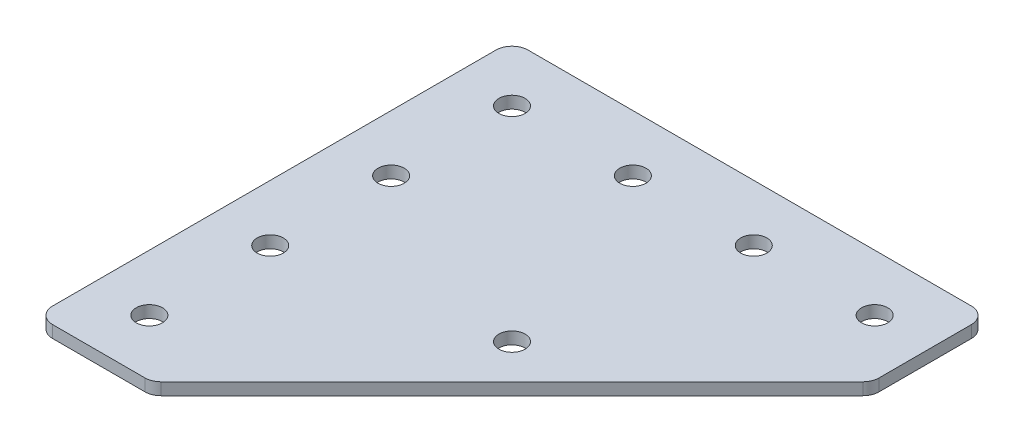
ISO-10303-21;
HEADER;
FILE_DESCRIPTION(('STEP AP214'),'2;1');
FILE_NAME('part.step','',(''),(''),'','','');
FILE_SCHEMA(('AUTOMOTIVE_DESIGN { 1 0 10303 214 1 1 1 1 }'));
ENDSEC;
DATA;
#1=APPLICATION_CONTEXT('core data for automotive mechanical design processes');
#2=APPLICATION_PROTOCOL_DEFINITION('international standard','automotive_design',2000,#1);
#3=PRODUCT_CONTEXT('',#1,'mechanical');
#4=PRODUCT('Part','Part','',(#3));
#5=PRODUCT_RELATED_PRODUCT_CATEGORY('part','',(#4));
#6=PRODUCT_DEFINITION_FORMATION('','',#4);
#7=PRODUCT_DEFINITION_CONTEXT('part definition',#1,'design');
#8=PRODUCT_DEFINITION('design','',#6,#7);
#9=PRODUCT_DEFINITION_SHAPE('','',#8);
#10=(LENGTH_UNIT() NAMED_UNIT(*) SI_UNIT(.MILLI.,.METRE.));
#11=(NAMED_UNIT(*) PLANE_ANGLE_UNIT() SI_UNIT($,.RADIAN.));
#12=(NAMED_UNIT(*) SI_UNIT($,.STERADIAN.) SOLID_ANGLE_UNIT());
#13=UNCERTAINTY_MEASURE_WITH_UNIT(LENGTH_MEASURE(1.E-05),#10,'distance_accuracy_value','');
#14=(GEOMETRIC_REPRESENTATION_CONTEXT(3) GLOBAL_UNCERTAINTY_ASSIGNED_CONTEXT((#13)) GLOBAL_UNIT_ASSIGNED_CONTEXT((#10,
#11,#12)) REPRESENTATION_CONTEXT('',''));
#15=CARTESIAN_POINT('',(0.,0.,0.));
#16=DIRECTION('',(0.,0.,1.));
#17=DIRECTION('',(1.,0.,0.));
#18=AXIS2_PLACEMENT_3D('',#15,#16,#17);
#19=CARTESIAN_POINT('',(-23.8452108311752,1.74134831028641,-23.6457325979904));
#20=DIRECTION('',(0.,-1.,0.));
#21=DIRECTION('',(0.,0.,-1.));
#22=AXIS2_PLACEMENT_3D('',#19,#20,#21);
#23=PLANE('',#22);
#24=CARTESIAN_POINT('',(1.48321629357095,1.74134831028641,1.68269452675578));
#25=DIRECTION('',(0.,1.,0.));
#26=DIRECTION('',(0.,0.,1.));
#27=AXIS2_PLACEMENT_3D('',#24,#25,#26);
#28=CIRCLE('',#27,1.625);
#29=CARTESIAN_POINT('',(1.48321629357095,1.74134831028641,3.30769452675578));
#30=VERTEX_POINT('',#29);
#31=EDGE_CURVE('E265',#30,#30,#28,.T.);
#32=ORIENTED_EDGE('',*,*,#31,.T.);
#33=EDGE_LOOP('',(#32));
#34=FACE_BOUND('',#33,.T.);
#35=CARTESIAN_POINT('',(-23.8452108311748,1.74134831028641,21.3542674020096));
#36=DIRECTION('',(0.,1.,0.));
#37=DIRECTION('',(0.,0.,1.));
#38=AXIS2_PLACEMENT_3D('',#35,#36,#37);
#39=CIRCLE('',#38,1.625);
#40=CARTESIAN_POINT('',(-23.8452108311748,1.74134831028641,22.9792674020096));
#41=VERTEX_POINT('',#40);
#42=EDGE_CURVE('E260',#41,#41,#39,.T.);
#43=ORIENTED_EDGE('',*,*,#42,.T.);
#44=EDGE_LOOP('',(#43));
#45=FACE_BOUND('',#44,.T.);
#46=CARTESIAN_POINT('',(-23.8452108311749,1.74134831028641,6.3542674020096));
#47=DIRECTION('',(0.,1.,0.));
#48=DIRECTION('',(0.,0.,1.));
#49=AXIS2_PLACEMENT_3D('',#46,#47,#48);
#50=CIRCLE('',#49,1.625);
#51=CARTESIAN_POINT('',(-23.8452108311749,1.74134831028641,7.9792674020096));
#52=VERTEX_POINT('',#51);
#53=EDGE_CURVE('E273',#52,#52,#50,.T.);
#54=ORIENTED_EDGE('',*,*,#53,.T.);
#55=EDGE_LOOP('',(#54));
#56=FACE_BOUND('',#55,.T.);
#57=CARTESIAN_POINT('',(-23.8452108311753,1.74134831028641,-8.6457325979904));
#58=DIRECTION('',(0.,1.,0.));
#59=DIRECTION('',(0.,0.,1.));
#60=AXIS2_PLACEMENT_3D('',#57,#58,#59);
#61=CIRCLE('',#60,1.62500000000016);
#62=CARTESIAN_POINT('',(-23.8452108311753,1.74134831028641,-7.02073259799024));
#63=VERTEX_POINT('',#62);
#64=EDGE_CURVE('E279',#63,#63,#61,.T.);
#65=ORIENTED_EDGE('',*,*,#64,.T.);
#66=EDGE_LOOP('',(#65));
#67=FACE_BOUND('',#66,.T.);
#68=CARTESIAN_POINT('',(21.1547891688248,1.74134831028641,-23.6457325979904));
#69=DIRECTION('',(0.,1.,0.));
#70=DIRECTION('',(0.,0.,1.));
#71=AXIS2_PLACEMENT_3D('',#68,#69,#70);
#72=CIRCLE('',#71,1.625);
#73=CARTESIAN_POINT('',(21.1547891688248,1.74134831028641,-22.0207325979904));
#74=VERTEX_POINT('',#73);
#75=EDGE_CURVE('E285',#74,#74,#72,.T.);
#76=ORIENTED_EDGE('',*,*,#75,.T.);
#77=EDGE_LOOP('',(#76));
#78=FACE_BOUND('',#77,.T.);
#79=CARTESIAN_POINT('',(6.15478916882476,1.74134831028641,-23.6457325979904));
#80=DIRECTION('',(0.,1.,0.));
#81=DIRECTION('',(0.,0.,1.));
#82=AXIS2_PLACEMENT_3D('',#79,#80,#81);
#83=CIRCLE('',#82,1.625);
#84=CARTESIAN_POINT('',(6.15478916882476,1.74134831028641,-22.0207325979904));
#85=VERTEX_POINT('',#84);
#86=EDGE_CURVE('E291',#85,#85,#83,.T.);
#87=ORIENTED_EDGE('',*,*,#86,.T.);
#88=EDGE_LOOP('',(#87));
#89=FACE_BOUND('',#88,.T.);
#90=CARTESIAN_POINT('',(-8.84521083117524,1.74134831028641,-23.6457325979904));
#91=DIRECTION('',(0.,1.,0.));
#92=DIRECTION('',(0.,0.,1.));
#93=AXIS2_PLACEMENT_3D('',#90,#91,#92);
#94=CIRCLE('',#93,1.625);
#95=CARTESIAN_POINT('',(-8.84521083117524,1.74134831028641,-22.0207325979904));
#96=VERTEX_POINT('',#95);
#97=EDGE_CURVE('E297',#96,#96,#94,.T.);
#98=ORIENTED_EDGE('',*,*,#97,.T.);
#99=EDGE_LOOP('',(#98));
#100=FACE_BOUND('',#99,.T.);
#101=CARTESIAN_POINT('',(-23.8452108311752,1.74134831028641,-23.6457325979904));
#102=DIRECTION('',(0.,1.,0.));
#103=DIRECTION('',(0.,0.,1.));
#104=AXIS2_PLACEMENT_3D('',#101,#102,#103);
#105=CIRCLE('',#104,1.625);
#106=CARTESIAN_POINT('',(-23.8452108311752,1.74134831028641,-22.0207325979904));
#107=VERTEX_POINT('',#106);
#108=EDGE_CURVE('E175',#107,#107,#105,.T.);
#109=ORIENTED_EDGE('',*,*,#108,.T.);
#110=EDGE_LOOP('',(#109));
#111=FACE_BOUND('',#110,.T.);
#112=DIRECTION('',(0.707106781186547,0.,-0.707106781186548));
#113=VECTOR('',#112,1.);
#114=CARTESIAN_POINT('',(-16.5523176123617,1.74134831028641,28.3542674020096));
#115=LINE('',#114,#113);
#116=CARTESIAN_POINT('',(-15.9665311747348,1.74134831028641,27.7684809643826));
#117=VERTEX_POINT('',#116);
#118=CARTESIAN_POINT('',(27.5690027311978,1.74134831028641,-15.76705294155));
#119=VERTEX_POINT('',#118);
#120=EDGE_CURVE('E121',#117,#119,#115,.T.);
#121=ORIENTED_EDGE('',*,*,#120,.F.);
#122=CARTESIAN_POINT('',(-17.3807447371079,1.74134831028641,26.3542674020096));
#123=DIRECTION('',(0.,-1.,0.));
#124=DIRECTION('',(0.,0.,-1.));
#125=AXIS2_PLACEMENT_3D('',#122,#123,#124);
#126=CIRCLE('',#125,2.);
#127=CARTESIAN_POINT('',(-17.3807447371079,1.74134831028641,28.3542674020096));
#128=VERTEX_POINT('',#127);
#129=EDGE_CURVE('E145',#117,#128,#126,.T.);
#130=ORIENTED_EDGE('',*,*,#129,.T.);
#131=DIRECTION('',(1.,0.,0.));
#132=VECTOR('',#131,1.);
#133=CARTESIAN_POINT('',(-30.8452108311753,1.74134831028641,28.3542674020096));
#134=LINE('',#133,#132);
#135=CARTESIAN_POINT('',(-28.8452108311753,1.74134831028641,28.3542674020096));
#136=VERTEX_POINT('',#135);
#137=EDGE_CURVE('E162',#136,#128,#134,.T.);
#138=ORIENTED_EDGE('',*,*,#137,.F.);
#139=CARTESIAN_POINT('',(-28.8452108311753,1.74134831028641,26.3542674020096));
#140=DIRECTION('',(0.,-1.,0.));
#141=DIRECTION('',(0.,0.,-1.));
#142=AXIS2_PLACEMENT_3D('',#139,#140,#141);
#143=CIRCLE('',#142,2.);
#144=CARTESIAN_POINT('',(-30.8452108311753,1.74134831028641,26.3542674020096));
#145=VERTEX_POINT('',#144);
#146=EDGE_CURVE('E117',#136,#145,#143,.T.);
#147=ORIENTED_EDGE('',*,*,#146,.T.);
#148=DIRECTION('',(0.,0.,1.));
#149=VECTOR('',#148,1.);
#150=CARTESIAN_POINT('',(-30.8452108311753,1.74134831028641,-30.6457325979904));
#151=LINE('',#150,#149);
#152=CARTESIAN_POINT('',(-30.8452108311753,1.74134831028641,-28.6457325979904));
#153=VERTEX_POINT('',#152);
#154=EDGE_CURVE('E160',#153,#145,#151,.T.);
#155=ORIENTED_EDGE('',*,*,#154,.F.);
#156=CARTESIAN_POINT('',(-28.8452108311753,1.74134831028641,-28.6457325979904));
#157=DIRECTION('',(0.,-1.,0.));
#158=DIRECTION('',(0.,0.,-1.));
#159=AXIS2_PLACEMENT_3D('',#156,#157,#158);
#160=CIRCLE('',#159,2.);
#161=CARTESIAN_POINT('',(-28.8452108311753,1.74134831028641,-30.6457325979904));
#162=VERTEX_POINT('',#161);
#163=EDGE_CURVE('E140',#153,#162,#160,.T.);
#164=ORIENTED_EDGE('',*,*,#163,.T.);
#165=DIRECTION('',(-1.,0.,0.));
#166=VECTOR('',#165,1.);
#167=CARTESIAN_POINT('',(28.1547891688247,1.74134831028641,-30.6457325979905));
#168=LINE('',#167,#166);
#169=CARTESIAN_POINT('',(26.1547891688247,1.74134831028641,-30.6457325979905));
#170=VERTEX_POINT('',#169);
#171=EDGE_CURVE('E163',#170,#162,#168,.T.);
#172=ORIENTED_EDGE('',*,*,#171,.F.);
#173=CARTESIAN_POINT('',(26.1547891688247,1.74134831028641,-28.6457325979904));
#174=DIRECTION('',(0.,-1.,0.));
#175=DIRECTION('',(0.,0.,-1.));
#176=AXIS2_PLACEMENT_3D('',#173,#174,#175);
#177=CIRCLE('',#176,2.);
#178=CARTESIAN_POINT('',(28.1547891688247,1.74134831028641,-28.6457325979904));
#179=VERTEX_POINT('',#178);
#180=EDGE_CURVE('E31',#170,#179,#177,.T.);
#181=ORIENTED_EDGE('',*,*,#180,.T.);
#182=DIRECTION('',(0.,0.,-1.));
#183=VECTOR('',#182,1.);
#184=CARTESIAN_POINT('',(28.1547891688247,1.74134831028641,-16.3528393791769));
#185=LINE('',#184,#183);
#186=CARTESIAN_POINT('',(28.1547891688247,1.74134831028641,-17.1812665039231));
#187=VERTEX_POINT('',#186);
#188=EDGE_CURVE('E118',#187,#179,#185,.T.);
#189=ORIENTED_EDGE('',*,*,#188,.F.);
#190=CARTESIAN_POINT('',(26.1547891688247,1.74134831028641,-17.1812665039231));
#191=DIRECTION('',(0.,-1.,0.));
#192=DIRECTION('',(0.,0.,-1.));
#193=AXIS2_PLACEMENT_3D('',#190,#191,#192);
#194=CIRCLE('',#193,2.);
#195=EDGE_CURVE('E143',#187,#119,#194,.T.);
#196=ORIENTED_EDGE('',*,*,#195,.T.);
#197=EDGE_LOOP('',(#121,#130,#138,#147,#155,#164,#172,#181,#189,#196));
#198=FACE_BOUND('',#197,.T.);
#199=ADVANCED_FACE('F16',(#34,#45,#56,#67,#78,#89,#100,#111,#198),#23,.T.);
#200=CARTESIAN_POINT('',(28.1547891688247,1.74134831028641,-30.6457325979905));
#201=DIRECTION('',(0.,0.,-1.));
#202=DIRECTION('',(-1.,0.,0.));
#203=AXIS2_PLACEMENT_3D('',#200,#201,#202);
#204=PLANE('',#203);
#205=DIRECTION('',(-1.,0.,0.));
#206=VECTOR('',#205,1.);
#207=CARTESIAN_POINT('',(28.1547891688247,3.24134831028641,-30.6457325979905));
#208=LINE('',#207,#206);
#209=CARTESIAN_POINT('',(26.1547891688247,3.24134831028641,-30.6457325979905));
#210=VERTEX_POINT('',#209);
#211=CARTESIAN_POINT('',(-28.8452108311753,3.24134831028641,-30.6457325979904));
#212=VERTEX_POINT('',#211);
#213=EDGE_CURVE('E172',#210,#212,#208,.T.);
#214=ORIENTED_EDGE('',*,*,#213,.F.);
#215=DIRECTION('',(0.,1.,0.));
#216=VECTOR('',#215,1.);
#217=CARTESIAN_POINT('',(26.1547891688247,1.74134831028641,-30.6457325979905));
#218=LINE('',#217,#216);
#219=EDGE_CURVE('E154',#210,#170,#218,.F.);
#220=ORIENTED_EDGE('',*,*,#219,.T.);
#221=ORIENTED_EDGE('',*,*,#171,.T.);
#222=DIRECTION('',(0.,1.,0.));
#223=VECTOR('',#222,1.);
#224=CARTESIAN_POINT('',(-28.8452108311753,1.74134831028641,-30.6457325979904));
#225=LINE('',#224,#223);
#226=EDGE_CURVE('E151',#162,#212,#225,.T.);
#227=ORIENTED_EDGE('',*,*,#226,.T.);
#228=EDGE_LOOP('',(#214,#220,#221,#227));
#229=FACE_BOUND('',#228,.T.);
#230=ADVANCED_FACE('F208',(#229),#204,.T.);
#231=CARTESIAN_POINT('',(28.1547891688247,1.74134831028641,-16.3528393791769));
#232=DIRECTION('',(1.,0.,0.));
#233=DIRECTION('',(0.,0.,-1.));
#234=AXIS2_PLACEMENT_3D('',#231,#232,#233);
#235=PLANE('',#234);
#236=DIRECTION('',(0.,0.,-1.));
#237=VECTOR('',#236,1.);
#238=CARTESIAN_POINT('',(28.1547891688247,3.24134831028641,-16.3528393791769));
#239=LINE('',#238,#237);
#240=CARTESIAN_POINT('',(28.1547891688247,3.24134831028641,-17.1812665039231));
#241=VERTEX_POINT('',#240);
#242=CARTESIAN_POINT('',(28.1547891688247,3.24134831028641,-28.6457325979904));
#243=VERTEX_POINT('',#242);
#244=EDGE_CURVE('E124',#241,#243,#239,.T.);
#245=ORIENTED_EDGE('',*,*,#244,.F.);
#246=DIRECTION('',(0.,1.,0.));
#247=VECTOR('',#246,1.);
#248=CARTESIAN_POINT('',(28.1547891688247,1.74134831028641,-17.1812665039231));
#249=LINE('',#248,#247);
#250=EDGE_CURVE('E38',#241,#187,#249,.F.);
#251=ORIENTED_EDGE('',*,*,#250,.T.);
#252=ORIENTED_EDGE('',*,*,#188,.T.);
#253=DIRECTION('',(0.,1.,0.));
#254=VECTOR('',#253,1.);
#255=CARTESIAN_POINT('',(28.1547891688247,1.74134831028641,-28.6457325979904));
#256=LINE('',#255,#254);
#257=EDGE_CURVE('E147',#179,#243,#256,.T.);
#258=ORIENTED_EDGE('',*,*,#257,.T.);
#259=EDGE_LOOP('',(#245,#251,#252,#258));
#260=FACE_BOUND('',#259,.T.);
#261=ADVANCED_FACE('F180',(#260),#235,.T.);
#262=CARTESIAN_POINT('',(-16.5523176123617,1.74134831028641,28.3542674020096));
#263=DIRECTION('',(0.707106781186548,0.,0.707106781186547));
#264=DIRECTION('',(0.707106781186547,0.,-0.707106781186548));
#265=AXIS2_PLACEMENT_3D('',#262,#263,#264);
#266=PLANE('',#265);
#267=DIRECTION('',(0.707106781186547,0.,-0.707106781186548));
#268=VECTOR('',#267,1.);
#269=CARTESIAN_POINT('',(-16.5523176123617,3.24134831028641,28.3542674020096));
#270=LINE('',#269,#268);
#271=CARTESIAN_POINT('',(-15.9665311747348,3.24134831028641,27.7684809643826));
#272=VERTEX_POINT('',#271);
#273=CARTESIAN_POINT('',(27.5690027311978,3.24134831028641,-15.76705294155));
#274=VERTEX_POINT('',#273);
#275=EDGE_CURVE('E114',#272,#274,#270,.T.);
#276=ORIENTED_EDGE('',*,*,#275,.F.);
#277=DIRECTION('',(0.,1.,0.));
#278=VECTOR('',#277,1.);
#279=CARTESIAN_POINT('',(-15.9665311747348,1.74134831028641,27.7684809643826));
#280=LINE('',#279,#278);
#281=EDGE_CURVE('E137',#272,#117,#280,.F.);
#282=ORIENTED_EDGE('',*,*,#281,.T.);
#283=ORIENTED_EDGE('',*,*,#120,.T.);
#284=DIRECTION('',(0.,1.,0.));
#285=VECTOR('',#284,1.);
#286=CARTESIAN_POINT('',(27.5690027311978,1.74134831028641,-15.76705294155));
#287=LINE('',#286,#285);
#288=EDGE_CURVE('E134',#119,#274,#287,.T.);
#289=ORIENTED_EDGE('',*,*,#288,.T.);
#290=EDGE_LOOP('',(#276,#282,#283,#289));
#291=FACE_BOUND('',#290,.T.);
#292=ADVANCED_FACE('F189',(#291),#266,.T.);
#293=CARTESIAN_POINT('',(-30.8452108311753,1.74134831028641,28.3542674020096));
#294=DIRECTION('',(0.,0.,1.));
#295=DIRECTION('',(1.,0.,0.));
#296=AXIS2_PLACEMENT_3D('',#293,#294,#295);
#297=PLANE('',#296);
#298=ORIENTED_EDGE('',*,*,#137,.T.);
#299=DIRECTION('',(0.,1.,0.));
#300=VECTOR('',#299,1.);
#301=CARTESIAN_POINT('',(-17.3807447371079,1.74134831028641,28.3542674020096));
#302=LINE('',#301,#300);
#303=CARTESIAN_POINT('',(-17.3807447371079,3.24134831028641,28.3542674020096));
#304=VERTEX_POINT('',#303);
#305=EDGE_CURVE('E105',#128,#304,#302,.T.);
#306=ORIENTED_EDGE('',*,*,#305,.T.);
#307=DIRECTION('',(1.,0.,0.));
#308=VECTOR('',#307,1.);
#309=CARTESIAN_POINT('',(-30.8452108311753,3.24134831028641,28.3542674020096));
#310=LINE('',#309,#308);
#311=CARTESIAN_POINT('',(-28.8452108311753,3.24134831028641,28.3542674020096));
#312=VERTEX_POINT('',#311);
#313=EDGE_CURVE('E97',#312,#304,#310,.T.);
#314=ORIENTED_EDGE('',*,*,#313,.F.);
#315=DIRECTION('',(0.,1.,0.));
#316=VECTOR('',#315,1.);
#317=CARTESIAN_POINT('',(-28.8452108311753,1.74134831028641,28.3542674020096));
#318=LINE('',#317,#316);
#319=EDGE_CURVE('E111',#312,#136,#318,.F.);
#320=ORIENTED_EDGE('',*,*,#319,.T.);
#321=EDGE_LOOP('',(#298,#306,#314,#320));
#322=FACE_BOUND('',#321,.T.);
#323=ADVANCED_FACE('F110',(#322),#297,.T.);
#324=CARTESIAN_POINT('',(-30.8452108311753,1.74134831028641,-30.6457325979904));
#325=DIRECTION('',(-1.,0.,0.));
#326=DIRECTION('',(0.,0.,1.));
#327=AXIS2_PLACEMENT_3D('',#324,#325,#326);
#328=PLANE('',#327);
#329=DIRECTION('',(0.,0.,1.));
#330=VECTOR('',#329,1.);
#331=CARTESIAN_POINT('',(-30.8452108311753,3.24134831028641,-30.6457325979904));
#332=LINE('',#331,#330);
#333=CARTESIAN_POINT('',(-30.8452108311753,3.24134831028641,-28.6457325979904));
#334=VERTEX_POINT('',#333);
#335=CARTESIAN_POINT('',(-30.8452108311753,3.24134831028641,26.3542674020096));
#336=VERTEX_POINT('',#335);
#337=EDGE_CURVE('E99',#334,#336,#332,.T.);
#338=ORIENTED_EDGE('',*,*,#337,.F.);
#339=DIRECTION('',(0.,1.,0.));
#340=VECTOR('',#339,1.);
#341=CARTESIAN_POINT('',(-30.8452108311753,1.74134831028641,-28.6457325979904));
#342=LINE('',#341,#340);
#343=EDGE_CURVE('E10',#334,#153,#342,.F.);
#344=ORIENTED_EDGE('',*,*,#343,.T.);
#345=ORIENTED_EDGE('',*,*,#154,.T.);
#346=DIRECTION('',(0.,1.,0.));
#347=VECTOR('',#346,1.);
#348=CARTESIAN_POINT('',(-30.8452108311753,1.74134831028641,26.3542674020096));
#349=LINE('',#348,#347);
#350=EDGE_CURVE('E24',#145,#336,#349,.T.);
#351=ORIENTED_EDGE('',*,*,#350,.T.);
#352=EDGE_LOOP('',(#338,#344,#345,#351));
#353=FACE_BOUND('',#352,.T.);
#354=ADVANCED_FACE('F157',(#353),#328,.T.);
#355=CARTESIAN_POINT('',(-23.8452108311752,3.24134831028641,-23.6457325979904));
#356=DIRECTION('',(0.,-1.,0.));
#357=DIRECTION('',(0.,0.,-1.));
#358=AXIS2_PLACEMENT_3D('',#355,#356,#357);
#359=PLANE('',#358);
#360=CARTESIAN_POINT('',(1.48321629357095,3.24134831028641,1.68269452675578));
#361=DIRECTION('',(0.,1.,0.));
#362=DIRECTION('',(0.,0.,1.));
#363=AXIS2_PLACEMENT_3D('',#360,#361,#362);
#364=CIRCLE('',#363,1.625);
#365=CARTESIAN_POINT('',(1.48321629357095,3.24134831028641,3.30769452675578));
#366=VERTEX_POINT('',#365);
#367=EDGE_CURVE('E269',#366,#366,#364,.T.);
#368=ORIENTED_EDGE('',*,*,#367,.F.);
#369=EDGE_LOOP('',(#368));
#370=FACE_BOUND('',#369,.T.);
#371=CARTESIAN_POINT('',(-23.8452108311748,3.24134831028641,21.3542674020096));
#372=DIRECTION('',(0.,1.,0.));
#373=DIRECTION('',(0.,0.,1.));
#374=AXIS2_PLACEMENT_3D('',#371,#372,#373);
#375=CIRCLE('',#374,1.625);
#376=CARTESIAN_POINT('',(-23.8452108311748,3.24134831028641,22.9792674020096));
#377=VERTEX_POINT('',#376);
#378=EDGE_CURVE('E263',#377,#377,#375,.T.);
#379=ORIENTED_EDGE('',*,*,#378,.F.);
#380=EDGE_LOOP('',(#379));
#381=FACE_BOUND('',#380,.T.);
#382=CARTESIAN_POINT('',(-23.8452108311749,3.24134831028641,6.3542674020096));
#383=DIRECTION('',(0.,1.,0.));
#384=DIRECTION('',(0.,0.,1.));
#385=AXIS2_PLACEMENT_3D('',#382,#383,#384);
#386=CIRCLE('',#385,1.625);
#387=CARTESIAN_POINT('',(-23.8452108311749,3.24134831028641,7.9792674020096));
#388=VERTEX_POINT('',#387);
#389=EDGE_CURVE('E267',#388,#388,#386,.T.);
#390=ORIENTED_EDGE('',*,*,#389,.F.);
#391=EDGE_LOOP('',(#390));
#392=FACE_BOUND('',#391,.T.);
#393=CARTESIAN_POINT('',(-23.8452108311753,3.24134831028641,-8.6457325979904));
#394=DIRECTION('',(0.,1.,0.));
#395=DIRECTION('',(0.,0.,1.));
#396=AXIS2_PLACEMENT_3D('',#393,#394,#395);
#397=CIRCLE('',#396,1.62500000000016);
#398=CARTESIAN_POINT('',(-23.8452108311753,3.24134831028641,-7.02073259799024));
#399=VERTEX_POINT('',#398);
#400=EDGE_CURVE('E276',#399,#399,#397,.T.);
#401=ORIENTED_EDGE('',*,*,#400,.F.);
#402=EDGE_LOOP('',(#401));
#403=FACE_BOUND('',#402,.T.);
#404=CARTESIAN_POINT('',(21.1547891688248,3.24134831028641,-23.6457325979904));
#405=DIRECTION('',(0.,1.,0.));
#406=DIRECTION('',(0.,0.,1.));
#407=AXIS2_PLACEMENT_3D('',#404,#405,#406);
#408=CIRCLE('',#407,1.625);
#409=CARTESIAN_POINT('',(21.1547891688248,3.24134831028641,-22.0207325979904));
#410=VERTEX_POINT('',#409);
#411=EDGE_CURVE('E282',#410,#410,#408,.T.);
#412=ORIENTED_EDGE('',*,*,#411,.F.);
#413=EDGE_LOOP('',(#412));
#414=FACE_BOUND('',#413,.T.);
#415=CARTESIAN_POINT('',(6.15478916882476,3.24134831028641,-23.6457325979904));
#416=DIRECTION('',(0.,1.,0.));
#417=DIRECTION('',(0.,0.,1.));
#418=AXIS2_PLACEMENT_3D('',#415,#416,#417);
#419=CIRCLE('',#418,1.625);
#420=CARTESIAN_POINT('',(6.15478916882476,3.24134831028641,-22.0207325979904));
#421=VERTEX_POINT('',#420);
#422=EDGE_CURVE('E288',#421,#421,#419,.T.);
#423=ORIENTED_EDGE('',*,*,#422,.F.);
#424=EDGE_LOOP('',(#423));
#425=FACE_BOUND('',#424,.T.);
#426=CARTESIAN_POINT('',(-8.84521083117524,3.24134831028641,-23.6457325979904));
#427=DIRECTION('',(0.,1.,0.));
#428=DIRECTION('',(0.,0.,1.));
#429=AXIS2_PLACEMENT_3D('',#426,#427,#428);
#430=CIRCLE('',#429,1.625);
#431=CARTESIAN_POINT('',(-8.84521083117524,3.24134831028641,-22.0207325979904));
#432=VERTEX_POINT('',#431);
#433=EDGE_CURVE('E294',#432,#432,#430,.T.);
#434=ORIENTED_EDGE('',*,*,#433,.F.);
#435=EDGE_LOOP('',(#434));
#436=FACE_BOUND('',#435,.T.);
#437=CARTESIAN_POINT('',(-23.8452108311752,3.24134831028641,-23.6457325979904));
#438=DIRECTION('',(0.,1.,0.));
#439=DIRECTION('',(0.,0.,1.));
#440=AXIS2_PLACEMENT_3D('',#437,#438,#439);
#441=CIRCLE('',#440,1.625);
#442=CARTESIAN_POINT('',(-23.8452108311752,3.24134831028641,-22.0207325979904));
#443=VERTEX_POINT('',#442);
#444=EDGE_CURVE('E300',#443,#443,#441,.T.);
#445=ORIENTED_EDGE('',*,*,#444,.F.);
#446=EDGE_LOOP('',(#445));
#447=FACE_BOUND('',#446,.T.);
#448=ORIENTED_EDGE('',*,*,#313,.T.);
#449=CARTESIAN_POINT('',(-17.3807447371079,3.24134831028641,26.3542674020096));
#450=DIRECTION('',(0.,-1.,0.));
#451=DIRECTION('',(0.,0.,-1.));
#452=AXIS2_PLACEMENT_3D('',#449,#450,#451);
#453=CIRCLE('',#452,2.);
#454=EDGE_CURVE('E132',#304,#272,#453,.F.);
#455=ORIENTED_EDGE('',*,*,#454,.T.);
#456=ORIENTED_EDGE('',*,*,#275,.T.);
#457=CARTESIAN_POINT('',(26.1547891688247,3.24134831028641,-17.1812665039231));
#458=DIRECTION('',(0.,-1.,0.));
#459=DIRECTION('',(0.,0.,-1.));
#460=AXIS2_PLACEMENT_3D('',#457,#458,#459);
#461=CIRCLE('',#460,2.);
#462=EDGE_CURVE('E130',#274,#241,#461,.F.);
#463=ORIENTED_EDGE('',*,*,#462,.T.);
#464=ORIENTED_EDGE('',*,*,#244,.T.);
#465=CARTESIAN_POINT('',(26.1547891688247,3.24134831028641,-28.6457325979904));
#466=DIRECTION('',(0.,-1.,0.));
#467=DIRECTION('',(0.,0.,-1.));
#468=AXIS2_PLACEMENT_3D('',#465,#466,#467);
#469=CIRCLE('',#468,2.);
#470=EDGE_CURVE('E128',#243,#210,#469,.F.);
#471=ORIENTED_EDGE('',*,*,#470,.T.);
#472=ORIENTED_EDGE('',*,*,#213,.T.);
#473=CARTESIAN_POINT('',(-28.8452108311753,3.24134831028641,-28.6457325979904));
#474=DIRECTION('',(0.,-1.,0.));
#475=DIRECTION('',(0.,0.,-1.));
#476=AXIS2_PLACEMENT_3D('',#473,#474,#475);
#477=CIRCLE('',#476,2.);
#478=EDGE_CURVE('E104',#212,#334,#477,.F.);
#479=ORIENTED_EDGE('',*,*,#478,.T.);
#480=ORIENTED_EDGE('',*,*,#337,.T.);
#481=CARTESIAN_POINT('',(-28.8452108311753,3.24134831028641,26.3542674020096));
#482=DIRECTION('',(0.,-1.,0.));
#483=DIRECTION('',(0.,0.,-1.));
#484=AXIS2_PLACEMENT_3D('',#481,#482,#483);
#485=CIRCLE('',#484,2.);
#486=EDGE_CURVE('E94',#336,#312,#485,.F.);
#487=ORIENTED_EDGE('',*,*,#486,.T.);
#488=EDGE_LOOP('',(#448,#455,#456,#463,#464,#471,#472,#479,#480,#487));
#489=FACE_BOUND('',#488,.T.);
#490=ADVANCED_FACE('F96',(#370,#381,#392,#403,#414,#425,#436,#447,#489),#359,.F.);
#491=CARTESIAN_POINT('',(-23.8452108311752,1.74134831028641,-23.6457325979904));
#492=DIRECTION('',(0.,1.,0.));
#493=DIRECTION('',(0.,0.,1.));
#494=AXIS2_PLACEMENT_3D('',#491,#492,#493);
#495=CYLINDRICAL_SURFACE('',#494,1.625);
#496=ORIENTED_EDGE('',*,*,#108,.F.);
#497=EDGE_LOOP('',(#496));
#498=FACE_BOUND('',#497,.T.);
#499=ORIENTED_EDGE('',*,*,#444,.T.);
#500=EDGE_LOOP('',(#499));
#501=FACE_BOUND('',#500,.T.);
#502=ADVANCED_FACE('F219',(#498,#501),#495,.F.);
#503=CARTESIAN_POINT('',(-8.84521083117524,1.74134831028641,-23.6457325979904));
#504=DIRECTION('',(0.,1.,0.));
#505=DIRECTION('',(0.,0.,1.));
#506=AXIS2_PLACEMENT_3D('',#503,#504,#505);
#507=CYLINDRICAL_SURFACE('',#506,1.625);
#508=ORIENTED_EDGE('',*,*,#97,.F.);
#509=EDGE_LOOP('',(#508));
#510=FACE_BOUND('',#509,.T.);
#511=ORIENTED_EDGE('',*,*,#433,.T.);
#512=EDGE_LOOP('',(#511));
#513=FACE_BOUND('',#512,.T.);
#514=ADVANCED_FACE('F232',(#510,#513),#507,.F.);
#515=CARTESIAN_POINT('',(6.15478916882476,1.74134831028641,-23.6457325979904));
#516=DIRECTION('',(0.,1.,0.));
#517=DIRECTION('',(0.,0.,1.));
#518=AXIS2_PLACEMENT_3D('',#515,#516,#517);
#519=CYLINDRICAL_SURFACE('',#518,1.625);
#520=ORIENTED_EDGE('',*,*,#86,.F.);
#521=EDGE_LOOP('',(#520));
#522=FACE_BOUND('',#521,.T.);
#523=ORIENTED_EDGE('',*,*,#422,.T.);
#524=EDGE_LOOP('',(#523));
#525=FACE_BOUND('',#524,.T.);
#526=ADVANCED_FACE('F236',(#522,#525),#519,.F.);
#527=CARTESIAN_POINT('',(21.1547891688248,1.74134831028641,-23.6457325979904));
#528=DIRECTION('',(0.,1.,0.));
#529=DIRECTION('',(0.,0.,1.));
#530=AXIS2_PLACEMENT_3D('',#527,#528,#529);
#531=CYLINDRICAL_SURFACE('',#530,1.625);
#532=ORIENTED_EDGE('',*,*,#75,.F.);
#533=EDGE_LOOP('',(#532));
#534=FACE_BOUND('',#533,.T.);
#535=ORIENTED_EDGE('',*,*,#411,.T.);
#536=EDGE_LOOP('',(#535));
#537=FACE_BOUND('',#536,.T.);
#538=ADVANCED_FACE('F240',(#534,#537),#531,.F.);
#539=CARTESIAN_POINT('',(-23.8452108311753,1.74134831028641,-8.6457325979904));
#540=DIRECTION('',(0.,1.,0.));
#541=DIRECTION('',(0.,0.,1.));
#542=AXIS2_PLACEMENT_3D('',#539,#540,#541);
#543=CYLINDRICAL_SURFACE('',#542,1.62500000000016);
#544=ORIENTED_EDGE('',*,*,#64,.F.);
#545=EDGE_LOOP('',(#544));
#546=FACE_BOUND('',#545,.T.);
#547=ORIENTED_EDGE('',*,*,#400,.T.);
#548=EDGE_LOOP('',(#547));
#549=FACE_BOUND('',#548,.T.);
#550=ADVANCED_FACE('F244',(#546,#549),#543,.F.);
#551=CARTESIAN_POINT('',(-23.8452108311749,1.74134831028641,6.3542674020096));
#552=DIRECTION('',(0.,1.,0.));
#553=DIRECTION('',(0.,0.,1.));
#554=AXIS2_PLACEMENT_3D('',#551,#552,#553);
#555=CYLINDRICAL_SURFACE('',#554,1.625);
#556=ORIENTED_EDGE('',*,*,#53,.F.);
#557=EDGE_LOOP('',(#556));
#558=FACE_BOUND('',#557,.T.);
#559=ORIENTED_EDGE('',*,*,#389,.T.);
#560=EDGE_LOOP('',(#559));
#561=FACE_BOUND('',#560,.T.);
#562=ADVANCED_FACE('F248',(#558,#561),#555,.F.);
#563=CARTESIAN_POINT('',(-23.8452108311748,1.74134831028641,21.3542674020096));
#564=DIRECTION('',(0.,1.,0.));
#565=DIRECTION('',(0.,0.,1.));
#566=AXIS2_PLACEMENT_3D('',#563,#564,#565);
#567=CYLINDRICAL_SURFACE('',#566,1.625);
#568=ORIENTED_EDGE('',*,*,#42,.F.);
#569=EDGE_LOOP('',(#568));
#570=FACE_BOUND('',#569,.T.);
#571=ORIENTED_EDGE('',*,*,#378,.T.);
#572=EDGE_LOOP('',(#571));
#573=FACE_BOUND('',#572,.T.);
#574=ADVANCED_FACE('F203',(#570,#573),#567,.F.);
#575=CARTESIAN_POINT('',(1.48321629357095,1.74134831028641,1.68269452675578));
#576=DIRECTION('',(0.,1.,0.));
#577=DIRECTION('',(0.,0.,1.));
#578=AXIS2_PLACEMENT_3D('',#575,#576,#577);
#579=CYLINDRICAL_SURFACE('',#578,1.625);
#580=ORIENTED_EDGE('',*,*,#31,.F.);
#581=EDGE_LOOP('',(#580));
#582=FACE_BOUND('',#581,.T.);
#583=ORIENTED_EDGE('',*,*,#367,.T.);
#584=EDGE_LOOP('',(#583));
#585=FACE_BOUND('',#584,.T.);
#586=ADVANCED_FACE('F194',(#582,#585),#579,.F.);
#587=CARTESIAN_POINT('',(-17.3807447371079,1.74134831028641,26.3542674020096));
#588=DIRECTION('',(0.,1.,0.));
#589=DIRECTION('',(0.,0.,1.));
#590=AXIS2_PLACEMENT_3D('',#587,#588,#589);
#591=CYLINDRICAL_SURFACE('',#590,2.);
#592=ORIENTED_EDGE('',*,*,#129,.F.);
#593=ORIENTED_EDGE('',*,*,#281,.F.);
#594=ORIENTED_EDGE('',*,*,#454,.F.);
#595=ORIENTED_EDGE('',*,*,#305,.F.);
#596=EDGE_LOOP('',(#592,#593,#594,#595));
#597=FACE_BOUND('',#596,.T.);
#598=ADVANCED_FACE('F192',(#597),#591,.T.);
#599=CARTESIAN_POINT('',(26.1547891688247,1.74134831028641,-17.1812665039231));
#600=DIRECTION('',(0.,1.,0.));
#601=DIRECTION('',(0.,0.,1.));
#602=AXIS2_PLACEMENT_3D('',#599,#600,#601);
#603=CYLINDRICAL_SURFACE('',#602,2.);
#604=ORIENTED_EDGE('',*,*,#195,.F.);
#605=ORIENTED_EDGE('',*,*,#250,.F.);
#606=ORIENTED_EDGE('',*,*,#462,.F.);
#607=ORIENTED_EDGE('',*,*,#288,.F.);
#608=EDGE_LOOP('',(#604,#605,#606,#607));
#609=FACE_BOUND('',#608,.T.);
#610=ADVANCED_FACE('F184',(#609),#603,.T.);
#611=CARTESIAN_POINT('',(26.1547891688247,1.74134831028641,-28.6457325979904));
#612=DIRECTION('',(0.,1.,0.));
#613=DIRECTION('',(0.,0.,1.));
#614=AXIS2_PLACEMENT_3D('',#611,#612,#613);
#615=CYLINDRICAL_SURFACE('',#614,2.);
#616=ORIENTED_EDGE('',*,*,#180,.F.);
#617=ORIENTED_EDGE('',*,*,#219,.F.);
#618=ORIENTED_EDGE('',*,*,#470,.F.);
#619=ORIENTED_EDGE('',*,*,#257,.F.);
#620=EDGE_LOOP('',(#616,#617,#618,#619));
#621=FACE_BOUND('',#620,.T.);
#622=ADVANCED_FACE('F201',(#621),#615,.T.);
#623=CARTESIAN_POINT('',(-28.8452108311753,1.74134831028641,-28.6457325979904));
#624=DIRECTION('',(0.,1.,0.));
#625=DIRECTION('',(0.,0.,1.));
#626=AXIS2_PLACEMENT_3D('',#623,#624,#625);
#627=CYLINDRICAL_SURFACE('',#626,2.);
#628=ORIENTED_EDGE('',*,*,#163,.F.);
#629=ORIENTED_EDGE('',*,*,#343,.F.);
#630=ORIENTED_EDGE('',*,*,#478,.F.);
#631=ORIENTED_EDGE('',*,*,#226,.F.);
#632=EDGE_LOOP('',(#628,#629,#630,#631));
#633=FACE_BOUND('',#632,.T.);
#634=ADVANCED_FACE('F369',(#633),#627,.T.);
#635=CARTESIAN_POINT('',(-28.8452108311753,1.74134831028641,26.3542674020096));
#636=DIRECTION('',(0.,1.,0.));
#637=DIRECTION('',(0.,0.,1.));
#638=AXIS2_PLACEMENT_3D('',#635,#636,#637);
#639=CYLINDRICAL_SURFACE('',#638,2.);
#640=ORIENTED_EDGE('',*,*,#146,.F.);
#641=ORIENTED_EDGE('',*,*,#319,.F.);
#642=ORIENTED_EDGE('',*,*,#486,.F.);
#643=ORIENTED_EDGE('',*,*,#350,.F.);
#644=EDGE_LOOP('',(#640,#641,#642,#643));
#645=FACE_BOUND('',#644,.T.);
#646=ADVANCED_FACE('F18',(#645),#639,.T.);
#647=CLOSED_SHELL('',(#199,#230,#261,#292,#323,#354,#490,#502,#514,#526,#538,#550,#562,#574,
#586,#598,#610,#622,#634,#646));
#648=MANIFOLD_SOLID_BREP('B1',#647);
#649=ADVANCED_BREP_SHAPE_REPRESENTATION('',(#18,#648),#14);
#650=SHAPE_DEFINITION_REPRESENTATION(#9,#649);
ENDSEC;
END-ISO-10303-21;
